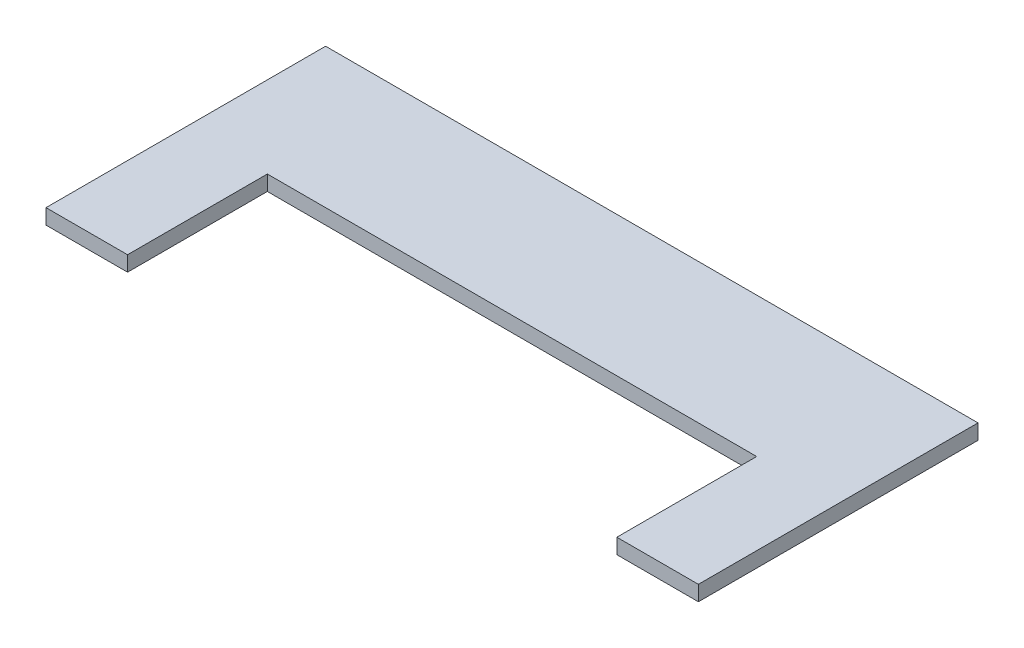
ISO-10303-21;
HEADER;
FILE_DESCRIPTION(('STEP AP214'),'2;1');
FILE_NAME('part.step','',(''),(''),'','','');
FILE_SCHEMA(('AUTOMOTIVE_DESIGN { 1 0 10303 214 1 1 1 1 }'));
ENDSEC;
DATA;
#1=APPLICATION_CONTEXT('core data for automotive mechanical design processes');
#2=APPLICATION_PROTOCOL_DEFINITION('international standard','automotive_design',2000,#1);
#3=PRODUCT_CONTEXT('',#1,'mechanical');
#4=PRODUCT('Part','Part','',(#3));
#5=PRODUCT_RELATED_PRODUCT_CATEGORY('part','',(#4));
#6=PRODUCT_DEFINITION_FORMATION('','',#4);
#7=PRODUCT_DEFINITION_CONTEXT('part definition',#1,'design');
#8=PRODUCT_DEFINITION('design','',#6,#7);
#9=PRODUCT_DEFINITION_SHAPE('','',#8);
#10=(LENGTH_UNIT() NAMED_UNIT(*) SI_UNIT(.MILLI.,.METRE.));
#11=(NAMED_UNIT(*) PLANE_ANGLE_UNIT() SI_UNIT($,.RADIAN.));
#12=(NAMED_UNIT(*) SI_UNIT($,.STERADIAN.) SOLID_ANGLE_UNIT());
#13=UNCERTAINTY_MEASURE_WITH_UNIT(LENGTH_MEASURE(1.E-05),#10,'distance_accuracy_value','');
#14=(GEOMETRIC_REPRESENTATION_CONTEXT(3) GLOBAL_UNCERTAINTY_ASSIGNED_CONTEXT((#13)) GLOBAL_UNIT_ASSIGNED_CONTEXT((#10,
#11,#12)) REPRESENTATION_CONTEXT('',''));
#15=CARTESIAN_POINT('',(0.,0.,0.));
#16=DIRECTION('',(0.,0.,1.));
#17=DIRECTION('',(1.,0.,0.));
#18=AXIS2_PLACEMENT_3D('',#15,#16,#17);
#19=CARTESIAN_POINT('',(0.,6.5,0.));
#20=DIRECTION('',(0.,0.,-1.));
#21=DIRECTION('',(-1.,0.,0.));
#22=AXIS2_PLACEMENT_3D('',#19,#20,#21);
#23=PLANE('',#22);
#24=DIRECTION('',(1.,0.,0.));
#25=VECTOR('',#24,1.);
#26=CARTESIAN_POINT('',(0.,0.,0.));
#27=LINE('',#26,#25);
#28=CARTESIAN_POINT('',(0.,0.,0.));
#29=VERTEX_POINT('',#28);
#30=CARTESIAN_POINT('',(35.,0.,0.));
#31=VERTEX_POINT('',#30);
#32=EDGE_CURVE('E129',#29,#31,#27,.T.);
#33=ORIENTED_EDGE('',*,*,#32,.T.);
#34=DIRECTION('',(0.,-1.,0.));
#35=VECTOR('',#34,1.);
#36=CARTESIAN_POINT('',(35.,6.5,0.));
#37=LINE('',#36,#35);
#38=CARTESIAN_POINT('',(35.,6.5,0.));
#39=VERTEX_POINT('',#38);
#40=EDGE_CURVE('E11',#39,#31,#37,.T.);
#41=ORIENTED_EDGE('',*,*,#40,.F.);
#42=DIRECTION('',(1.,0.,0.));
#43=VECTOR('',#42,1.);
#44=CARTESIAN_POINT('',(0.,6.5,0.));
#45=LINE('',#44,#43);
#46=CARTESIAN_POINT('',(0.,6.5,0.));
#47=VERTEX_POINT('',#46);
#48=EDGE_CURVE('E143',#47,#39,#45,.T.);
#49=ORIENTED_EDGE('',*,*,#48,.F.);
#50=DIRECTION('',(0.,-1.,0.));
#51=VECTOR('',#50,1.);
#52=CARTESIAN_POINT('',(0.,6.5,0.));
#53=LINE('',#52,#51);
#54=EDGE_CURVE('E125',#47,#29,#53,.T.);
#55=ORIENTED_EDGE('',*,*,#54,.T.);
#56=EDGE_LOOP('',(#33,#41,#49,#55));
#57=FACE_BOUND('',#56,.T.);
#58=ADVANCED_FACE('F33',(#57),#23,.F.);
#59=CARTESIAN_POINT('',(35.,6.5,0.));
#60=DIRECTION('',(-1.,0.,0.));
#61=DIRECTION('',(0.,0.,1.));
#62=AXIS2_PLACEMENT_3D('',#59,#60,#61);
#63=PLANE('',#62);
#64=DIRECTION('',(0.,0.,-1.));
#65=VECTOR('',#64,1.);
#66=CARTESIAN_POINT('',(35.,0.,0.));
#67=LINE('',#66,#65);
#68=CARTESIAN_POINT('',(35.,0.,-60.));
#69=VERTEX_POINT('',#68);
#70=EDGE_CURVE('E132',#31,#69,#67,.T.);
#71=ORIENTED_EDGE('',*,*,#70,.T.);
#72=DIRECTION('',(0.,-1.,0.));
#73=VECTOR('',#72,1.);
#74=CARTESIAN_POINT('',(35.,6.5,-60.));
#75=LINE('',#74,#73);
#76=CARTESIAN_POINT('',(35.,6.5,-60.));
#77=VERTEX_POINT('',#76);
#78=EDGE_CURVE('E41',#77,#69,#75,.T.);
#79=ORIENTED_EDGE('',*,*,#78,.F.);
#80=DIRECTION('',(0.,0.,-1.));
#81=VECTOR('',#80,1.);
#82=CARTESIAN_POINT('',(35.,6.5,0.));
#83=LINE('',#82,#81);
#84=EDGE_CURVE('E92',#39,#77,#83,.T.);
#85=ORIENTED_EDGE('',*,*,#84,.F.);
#86=ORIENTED_EDGE('',*,*,#40,.T.);
#87=EDGE_LOOP('',(#71,#79,#85,#86));
#88=FACE_BOUND('',#87,.T.);
#89=ADVANCED_FACE('F178',(#88),#63,.F.);
#90=CARTESIAN_POINT('',(35.,6.5,-60.));
#91=DIRECTION('',(0.,0.,-1.));
#92=DIRECTION('',(-1.,0.,0.));
#93=AXIS2_PLACEMENT_3D('',#90,#91,#92);
#94=PLANE('',#93);
#95=DIRECTION('',(1.,0.,0.));
#96=VECTOR('',#95,1.);
#97=CARTESIAN_POINT('',(35.,0.,-60.));
#98=LINE('',#97,#96);
#99=CARTESIAN_POINT('',(245.,0.,-60.));
#100=VERTEX_POINT('',#99);
#101=EDGE_CURVE('E134',#69,#100,#98,.T.);
#102=ORIENTED_EDGE('',*,*,#101,.T.);
#103=DIRECTION('',(0.,-1.,0.));
#104=VECTOR('',#103,1.);
#105=CARTESIAN_POINT('',(245.,6.5,-60.));
#106=LINE('',#105,#104);
#107=CARTESIAN_POINT('',(245.,6.5,-60.));
#108=VERTEX_POINT('',#107);
#109=EDGE_CURVE('E150',#108,#100,#106,.T.);
#110=ORIENTED_EDGE('',*,*,#109,.F.);
#111=DIRECTION('',(1.,0.,0.));
#112=VECTOR('',#111,1.);
#113=CARTESIAN_POINT('',(35.,6.5,-60.));
#114=LINE('',#113,#112);
#115=EDGE_CURVE('E158',#77,#108,#114,.T.);
#116=ORIENTED_EDGE('',*,*,#115,.F.);
#117=ORIENTED_EDGE('',*,*,#78,.T.);
#118=EDGE_LOOP('',(#102,#110,#116,#117));
#119=FACE_BOUND('',#118,.T.);
#120=ADVANCED_FACE('F156',(#119),#94,.F.);
#121=CARTESIAN_POINT('',(245.,6.5,0.));
#122=DIRECTION('',(1.,0.,0.));
#123=DIRECTION('',(0.,0.,-1.));
#124=AXIS2_PLACEMENT_3D('',#121,#122,#123);
#125=PLANE('',#124);
#126=DIRECTION('',(0.,0.,1.));
#127=VECTOR('',#126,1.);
#128=CARTESIAN_POINT('',(245.,0.,0.));
#129=LINE('',#128,#127);
#130=CARTESIAN_POINT('',(245.,0.,0.));
#131=VERTEX_POINT('',#130);
#132=EDGE_CURVE('E136',#100,#131,#129,.T.);
#133=ORIENTED_EDGE('',*,*,#132,.T.);
#134=DIRECTION('',(0.,-1.,0.));
#135=VECTOR('',#134,1.);
#136=CARTESIAN_POINT('',(245.,6.5,0.));
#137=LINE('',#136,#135);
#138=CARTESIAN_POINT('',(245.,6.5,0.));
#139=VERTEX_POINT('',#138);
#140=EDGE_CURVE('E147',#139,#131,#137,.T.);
#141=ORIENTED_EDGE('',*,*,#140,.F.);
#142=DIRECTION('',(0.,0.,1.));
#143=VECTOR('',#142,1.);
#144=CARTESIAN_POINT('',(245.,6.5,0.));
#145=LINE('',#144,#143);
#146=EDGE_CURVE('E170',#108,#139,#145,.T.);
#147=ORIENTED_EDGE('',*,*,#146,.F.);
#148=ORIENTED_EDGE('',*,*,#109,.T.);
#149=EDGE_LOOP('',(#133,#141,#147,#148));
#150=FACE_BOUND('',#149,.T.);
#151=ADVANCED_FACE('F166',(#150),#125,.F.);
#152=CARTESIAN_POINT('',(280.,6.5,0.));
#153=DIRECTION('',(0.,0.,-1.));
#154=DIRECTION('',(-1.,0.,0.));
#155=AXIS2_PLACEMENT_3D('',#152,#153,#154);
#156=PLANE('',#155);
#157=DIRECTION('',(1.,0.,0.));
#158=VECTOR('',#157,1.);
#159=CARTESIAN_POINT('',(280.,0.,0.));
#160=LINE('',#159,#158);
#161=CARTESIAN_POINT('',(280.,0.,0.));
#162=VERTEX_POINT('',#161);
#163=EDGE_CURVE('E138',#131,#162,#160,.T.);
#164=ORIENTED_EDGE('',*,*,#163,.T.);
#165=DIRECTION('',(0.,-1.,0.));
#166=VECTOR('',#165,1.);
#167=CARTESIAN_POINT('',(280.,6.5,0.));
#168=LINE('',#167,#166);
#169=CARTESIAN_POINT('',(280.,6.5,0.));
#170=VERTEX_POINT('',#169);
#171=EDGE_CURVE('E120',#170,#162,#168,.T.);
#172=ORIENTED_EDGE('',*,*,#171,.F.);
#173=DIRECTION('',(1.,0.,0.));
#174=VECTOR('',#173,1.);
#175=CARTESIAN_POINT('',(280.,6.5,0.));
#176=LINE('',#175,#174);
#177=EDGE_CURVE('E111',#139,#170,#176,.T.);
#178=ORIENTED_EDGE('',*,*,#177,.F.);
#179=ORIENTED_EDGE('',*,*,#140,.T.);
#180=EDGE_LOOP('',(#164,#172,#178,#179));
#181=FACE_BOUND('',#180,.T.);
#182=ADVANCED_FACE('F169',(#181),#156,.F.);
#183=CARTESIAN_POINT('',(280.,6.5,-120.));
#184=DIRECTION('',(-1.,0.,0.));
#185=DIRECTION('',(0.,0.,1.));
#186=AXIS2_PLACEMENT_3D('',#183,#184,#185);
#187=PLANE('',#186);
#188=DIRECTION('',(0.,0.,-1.));
#189=VECTOR('',#188,1.);
#190=CARTESIAN_POINT('',(280.,0.,-120.));
#191=LINE('',#190,#189);
#192=CARTESIAN_POINT('',(280.,0.,-120.));
#193=VERTEX_POINT('',#192);
#194=EDGE_CURVE('E119',#162,#193,#191,.T.);
#195=ORIENTED_EDGE('',*,*,#194,.T.);
#196=DIRECTION('',(0.,-1.,0.));
#197=VECTOR('',#196,1.);
#198=CARTESIAN_POINT('',(280.,6.5,-120.));
#199=LINE('',#198,#197);
#200=CARTESIAN_POINT('',(280.,6.5,-120.));
#201=VERTEX_POINT('',#200);
#202=EDGE_CURVE('E116',#201,#193,#199,.T.);
#203=ORIENTED_EDGE('',*,*,#202,.F.);
#204=DIRECTION('',(0.,0.,-1.));
#205=VECTOR('',#204,1.);
#206=CARTESIAN_POINT('',(280.,6.5,-120.));
#207=LINE('',#206,#205);
#208=EDGE_CURVE('E105',#170,#201,#207,.T.);
#209=ORIENTED_EDGE('',*,*,#208,.F.);
#210=ORIENTED_EDGE('',*,*,#171,.T.);
#211=EDGE_LOOP('',(#195,#203,#209,#210));
#212=FACE_BOUND('',#211,.T.);
#213=ADVANCED_FACE('F117',(#212),#187,.F.);
#214=CARTESIAN_POINT('',(0.,6.5,-120.));
#215=DIRECTION('',(0.,0.,1.));
#216=DIRECTION('',(1.,0.,0.));
#217=AXIS2_PLACEMENT_3D('',#214,#215,#216);
#218=PLANE('',#217);
#219=DIRECTION('',(-1.,0.,0.));
#220=VECTOR('',#219,1.);
#221=CARTESIAN_POINT('',(0.,0.,-120.));
#222=LINE('',#221,#220);
#223=CARTESIAN_POINT('',(0.,0.,-120.));
#224=VERTEX_POINT('',#223);
#225=EDGE_CURVE('E78',#193,#224,#222,.T.);
#226=ORIENTED_EDGE('',*,*,#225,.T.);
#227=DIRECTION('',(0.,-1.,0.));
#228=VECTOR('',#227,1.);
#229=CARTESIAN_POINT('',(0.,6.5,-120.));
#230=LINE('',#229,#228);
#231=CARTESIAN_POINT('',(0.,6.5,-120.));
#232=VERTEX_POINT('',#231);
#233=EDGE_CURVE('E121',#232,#224,#230,.T.);
#234=ORIENTED_EDGE('',*,*,#233,.F.);
#235=DIRECTION('',(-1.,0.,0.));
#236=VECTOR('',#235,1.);
#237=CARTESIAN_POINT('',(0.,6.5,-120.));
#238=LINE('',#237,#236);
#239=EDGE_CURVE('E109',#201,#232,#238,.T.);
#240=ORIENTED_EDGE('',*,*,#239,.F.);
#241=ORIENTED_EDGE('',*,*,#202,.T.);
#242=EDGE_LOOP('',(#226,#234,#240,#241));
#243=FACE_BOUND('',#242,.T.);
#244=ADVANCED_FACE('F123',(#243),#218,.F.);
#245=CARTESIAN_POINT('',(0.,6.5,0.));
#246=DIRECTION('',(1.,0.,0.));
#247=DIRECTION('',(0.,0.,-1.));
#248=AXIS2_PLACEMENT_3D('',#245,#246,#247);
#249=PLANE('',#248);
#250=DIRECTION('',(0.,0.,1.));
#251=VECTOR('',#250,1.);
#252=CARTESIAN_POINT('',(0.,0.,0.));
#253=LINE('',#252,#251);
#254=EDGE_CURVE('E84',#224,#29,#253,.T.);
#255=ORIENTED_EDGE('',*,*,#254,.T.);
#256=ORIENTED_EDGE('',*,*,#54,.F.);
#257=DIRECTION('',(0.,0.,1.));
#258=VECTOR('',#257,1.);
#259=CARTESIAN_POINT('',(0.,6.5,0.));
#260=LINE('',#259,#258);
#261=EDGE_CURVE('E49',#232,#47,#260,.T.);
#262=ORIENTED_EDGE('',*,*,#261,.F.);
#263=ORIENTED_EDGE('',*,*,#233,.T.);
#264=EDGE_LOOP('',(#255,#256,#262,#263));
#265=FACE_BOUND('',#264,.T.);
#266=ADVANCED_FACE('F194',(#265),#249,.F.);
#267=CARTESIAN_POINT('',(0.,6.5,0.));
#268=DIRECTION('',(0.,1.,0.));
#269=DIRECTION('',(0.,0.,1.));
#270=AXIS2_PLACEMENT_3D('',#267,#268,#269);
#271=PLANE('',#270);
#272=ORIENTED_EDGE('',*,*,#48,.T.);
#273=ORIENTED_EDGE('',*,*,#84,.T.);
#274=ORIENTED_EDGE('',*,*,#115,.T.);
#275=ORIENTED_EDGE('',*,*,#146,.T.);
#276=ORIENTED_EDGE('',*,*,#177,.T.);
#277=ORIENTED_EDGE('',*,*,#208,.T.);
#278=ORIENTED_EDGE('',*,*,#239,.T.);
#279=ORIENTED_EDGE('',*,*,#261,.T.);
#280=EDGE_LOOP('',(#272,#273,#274,#275,#276,#277,#278,#279));
#281=FACE_BOUND('',#280,.T.);
#282=ADVANCED_FACE('F107',(#281),#271,.T.);
#283=CARTESIAN_POINT('',(0.,0.,0.));
#284=DIRECTION('',(0.,1.,0.));
#285=DIRECTION('',(0.,0.,1.));
#286=AXIS2_PLACEMENT_3D('',#283,#284,#285);
#287=PLANE('',#286);
#288=ORIENTED_EDGE('',*,*,#32,.F.);
#289=ORIENTED_EDGE('',*,*,#254,.F.);
#290=ORIENTED_EDGE('',*,*,#225,.F.);
#291=ORIENTED_EDGE('',*,*,#194,.F.);
#292=ORIENTED_EDGE('',*,*,#163,.F.);
#293=ORIENTED_EDGE('',*,*,#132,.F.);
#294=ORIENTED_EDGE('',*,*,#101,.F.);
#295=ORIENTED_EDGE('',*,*,#70,.F.);
#296=EDGE_LOOP('',(#288,#289,#290,#291,#292,#293,#294,#295));
#297=FACE_BOUND('',#296,.T.);
#298=ADVANCED_FACE('F162',(#297),#287,.F.);
#299=CLOSED_SHELL('',(#58,#89,#120,#151,#182,#213,#244,#266,#282,#298));
#300=MANIFOLD_SOLID_BREP('B2',#299);
#301=ADVANCED_BREP_SHAPE_REPRESENTATION('',(#18,#300),#14);
#302=SHAPE_DEFINITION_REPRESENTATION(#9,#301);
ENDSEC;
END-ISO-10303-21;
